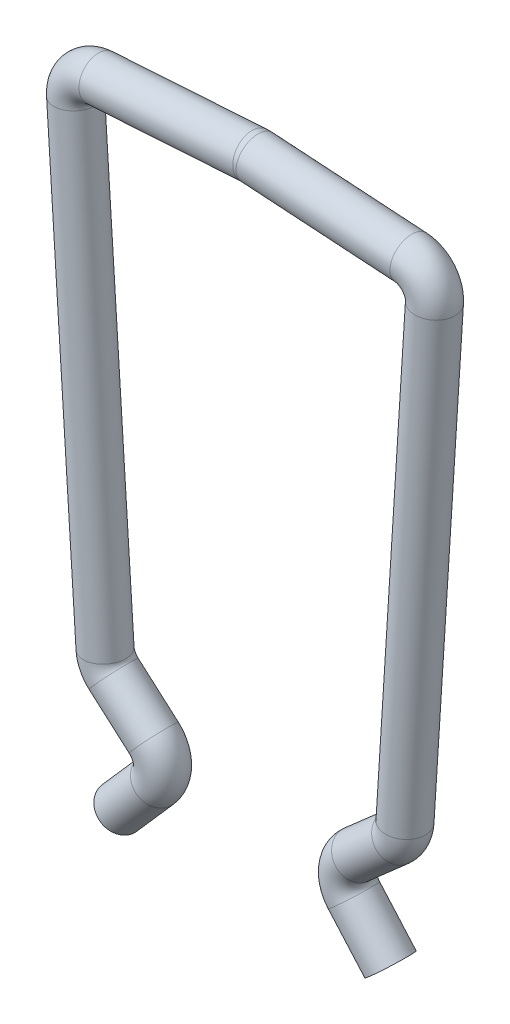
ISO-10303-21;
HEADER;
FILE_DESCRIPTION(('STEP AP214'),'2;1');
FILE_NAME('part.step','',(''),(''),'','','');
FILE_SCHEMA(('AUTOMOTIVE_DESIGN { 1 0 10303 214 1 1 1 1 }'));
ENDSEC;
DATA;
#1=APPLICATION_CONTEXT('core data for automotive mechanical design processes');
#2=APPLICATION_PROTOCOL_DEFINITION('international standard','automotive_design',2000,#1);
#3=PRODUCT_CONTEXT('',#1,'mechanical');
#4=PRODUCT('Part','Part','',(#3));
#5=PRODUCT_RELATED_PRODUCT_CATEGORY('part','',(#4));
#6=PRODUCT_DEFINITION_FORMATION('','',#4);
#7=PRODUCT_DEFINITION_CONTEXT('part definition',#1,'design');
#8=PRODUCT_DEFINITION('design','',#6,#7);
#9=PRODUCT_DEFINITION_SHAPE('','',#8);
#10=(LENGTH_UNIT() NAMED_UNIT(*) SI_UNIT(.MILLI.,.METRE.));
#11=(NAMED_UNIT(*) PLANE_ANGLE_UNIT() SI_UNIT($,.RADIAN.));
#12=(NAMED_UNIT(*) SI_UNIT($,.STERADIAN.) SOLID_ANGLE_UNIT());
#13=UNCERTAINTY_MEASURE_WITH_UNIT(LENGTH_MEASURE(1.E-05),#10,'distance_accuracy_value','');
#14=(GEOMETRIC_REPRESENTATION_CONTEXT(3) GLOBAL_UNCERTAINTY_ASSIGNED_CONTEXT((#13)) GLOBAL_UNIT_ASSIGNED_CONTEXT((#10,
#11,#12)) REPRESENTATION_CONTEXT('',''));
#15=CARTESIAN_POINT('',(0.,0.,0.));
#16=DIRECTION('',(0.,0.,1.));
#17=DIRECTION('',(1.,0.,0.));
#18=AXIS2_PLACEMENT_3D('',#15,#16,#17);
#19=CARTESIAN_POINT('',(1.92441755077506,-11.1004818464641,0.));
#20=DIRECTION('',(0.660114607728678,-0.751164898449876,0.));
#21=DIRECTION('',(0.751164898449877,0.660114607728678,0.));
#22=AXIS2_PLACEMENT_3D('',#19,#20,#21);
#23=CYLINDRICAL_SURFACE('',#22,0.4);
#24=CARTESIAN_POINT('',(1.92441755077506,-11.1004818464641,0.));
#25=DIRECTION('',(-0.660114607728679,0.751164898449876,0.));
#26=DIRECTION('',(-0.751164898449876,-0.660114607728679,0.));
#27=AXIS2_PLACEMENT_3D('',#24,#25,#26);
#28=CIRCLE('',#27,0.4);
#29=CARTESIAN_POINT('',(1.62395159139511,-11.3645276895556,0.));
#30=VERTEX_POINT('',#29);
#31=EDGE_CURVE('E49',#30,#30,#28,.T.);
#32=ORIENTED_EDGE('',*,*,#31,.F.);
#33=EDGE_LOOP('',(#32));
#34=FACE_BOUND('',#33,.T.);
#35=CARTESIAN_POINT('',(2.63727464717794,-11.9116640596122,0.));
#36=DIRECTION('',(-0.660114607728679,0.751164898449876,0.));
#37=DIRECTION('',(-0.751164898449876,-0.660114607728679,0.));
#38=AXIS2_PLACEMENT_3D('',#35,#36,#37);
#39=CIRCLE('',#38,0.4);
#40=CARTESIAN_POINT('',(2.33680868779799,-12.1757099027037,0.));
#41=VERTEX_POINT('',#40);
#42=EDGE_CURVE('E12',#41,#41,#39,.T.);
#43=ORIENTED_EDGE('',*,*,#42,.T.);
#44=EDGE_LOOP('',(#43));
#45=FACE_BOUND('',#44,.T.);
#46=ADVANCED_FACE('F43',(#34,#45),#23,.T.);
#47=CARTESIAN_POINT('',(2.3,-10.7704245425997,0.));
#48=DIRECTION('',(0.,0.,1.));
#49=DIRECTION('',(1.,0.,0.));
#50=AXIS2_PLACEMENT_3D('',#47,#48,#49);
#51=TOROIDAL_SURFACE('',#50,0.500000000000001,0.4);
#52=CARTESIAN_POINT('',(1.96994269613566,-10.3948420933748,0.));
#53=DIRECTION('',(0.751164898449883,0.660114607728672,0.));
#54=DIRECTION('',(-0.660114607728672,0.751164898449882,0.));
#55=AXIS2_PLACEMENT_3D('',#52,#53,#54);
#56=CIRCLE('',#55,0.4);
#57=CARTESIAN_POINT('',(1.70589685304419,-10.0943761339948,0.));
#58=VERTEX_POINT('',#57);
#59=EDGE_CURVE('E53',#58,#58,#56,.T.);
#60=CARTESIAN_POINT('',(2.3,-10.7704245425997,0.));
#61=DIRECTION('',(0.,0.,1.));
#62=DIRECTION('',(1.,0.,0.));
#63=AXIS2_PLACEMENT_3D('',#60,#61,#62);
#64=CIRCLE('',#63,0.900000000000001);
#65=EDGE_CURVE('',#58,#30,#64,.T.);
#66=ORIENTED_EDGE('',*,*,#59,.F.);
#67=ORIENTED_EDGE('',*,*,#31,.T.);
#68=ORIENTED_EDGE('',*,*,#65,.T.);
#69=ORIENTED_EDGE('',*,*,#65,.F.);
#70=EDGE_LOOP('',(#66,#68,#67,#69));
#71=FACE_BOUND('',#70,.T.);
#72=ADVANCED_FACE('F171',(#71),#51,.T.);
#73=CARTESIAN_POINT('',(2.74996559769337,-9.70936742230895,0.));
#74=DIRECTION('',(-0.751164898449882,-0.660114607728672,0.));
#75=DIRECTION('',(0.660114607728672,-0.751164898449882,0.));
#76=AXIS2_PLACEMENT_3D('',#73,#74,#75);
#77=CYLINDRICAL_SURFACE('',#76,0.4);
#78=CARTESIAN_POINT('',(2.74996559769337,-9.70936742230895,0.));
#79=DIRECTION('',(0.751164898449883,0.660114607728672,0.));
#80=DIRECTION('',(-0.660114607728672,0.751164898449882,0.));
#81=AXIS2_PLACEMENT_3D('',#78,#79,#80);
#82=CIRCLE('',#81,0.4);
#83=CARTESIAN_POINT('',(3.01401144078484,-10.0098333816889,0.));
#84=VERTEX_POINT('',#83);
#85=EDGE_CURVE('E57',#84,#84,#82,.T.);
#86=ORIENTED_EDGE('',*,*,#85,.F.);
#87=EDGE_LOOP('',(#86));
#88=FACE_BOUND('',#87,.T.);
#89=ORIENTED_EDGE('',*,*,#59,.T.);
#90=EDGE_LOOP('',(#89));
#91=FACE_BOUND('',#90,.T.);
#92=ADVANCED_FACE('F165',(#88,#91),#77,.T.);
#93=CARTESIAN_POINT('',(2.41990829382904,-9.33378497308401,0.));
#94=DIRECTION('',(0.,0.,-1.));
#95=DIRECTION('',(-1.,0.,0.));
#96=AXIS2_PLACEMENT_3D('',#93,#94,#95);
#97=TOROIDAL_SURFACE('',#96,0.499999999999998,0.4);
#98=CARTESIAN_POINT('',(2.91890363237202,-9.36546544202583,0.));
#99=DIRECTION('',(0.0633609378836384,0.997990677085967,0.));
#100=DIRECTION('',(-0.997990677085966,0.0633609378836384,0.));
#101=AXIS2_PLACEMENT_3D('',#98,#99,#100);
#102=CIRCLE('',#101,0.4);
#103=CARTESIAN_POINT('',(3.31809990320641,-9.39080981717928,0.));
#104=VERTEX_POINT('',#103);
#105=EDGE_CURVE('E62',#104,#104,#102,.T.);
#106=CARTESIAN_POINT('',(2.41990829382904,-9.33378497308401,0.));
#107=DIRECTION('',(0.,0.,-1.));
#108=DIRECTION('',(-1.,0.,0.));
#109=AXIS2_PLACEMENT_3D('',#106,#107,#108);
#110=CIRCLE('',#109,0.899999999999998);
#111=EDGE_CURVE('',#104,#84,#110,.T.);
#112=ORIENTED_EDGE('',*,*,#105,.F.);
#113=ORIENTED_EDGE('',*,*,#85,.T.);
#114=ORIENTED_EDGE('',*,*,#111,.T.);
#115=ORIENTED_EDGE('',*,*,#111,.F.);
#116=EDGE_LOOP('',(#112,#114,#113,#115));
#117=FACE_BOUND('',#116,.T.);
#118=ADVANCED_FACE('F159',(#117),#97,.T.);
#119=CARTESIAN_POINT('',(3.49286665827772,-0.325041357744119,0.));
#120=DIRECTION('',(-0.0633609378836405,-0.997990677085966,0.));
#121=DIRECTION('',(0.997990677085966,-0.0633609378836405,0.));
#122=AXIS2_PLACEMENT_3D('',#119,#120,#121);
#123=CYLINDRICAL_SURFACE('',#122,0.4);
#124=CARTESIAN_POINT('',(3.49286665827772,-0.325041357744119,0.));
#125=DIRECTION('',(0.0633609378836384,0.997990677085967,0.));
#126=DIRECTION('',(-0.997990677085966,0.0633609378836384,0.));
#127=AXIS2_PLACEMENT_3D('',#124,#125,#126);
#128=CIRCLE('',#127,0.4);
#129=CARTESIAN_POINT('',(3.89206292911211,-0.350385732897575,0.));
#130=VERTEX_POINT('',#129);
#131=EDGE_CURVE('E65',#130,#130,#128,.T.);
#132=ORIENTED_EDGE('',*,*,#131,.F.);
#133=EDGE_LOOP('',(#132));
#134=FACE_BOUND('',#133,.T.);
#135=ORIENTED_EDGE('',*,*,#105,.T.);
#136=EDGE_LOOP('',(#135));
#137=FACE_BOUND('',#136,.T.);
#138=ADVANCED_FACE('F153',(#134,#137),#123,.T.);
#139=CARTESIAN_POINT('',(2.99387131973474,-0.293360888802299,0.));
#140=DIRECTION('',(0.,0.,-1.));
#141=DIRECTION('',(-1.,0.,0.));
#142=AXIS2_PLACEMENT_3D('',#139,#140,#141);
#143=TOROIDAL_SURFACE('',#142,0.499999999999997,0.4);
#144=CARTESIAN_POINT('',(3.02606245873372,0.205601765681927,0.));
#145=DIRECTION('',(-0.997925308968459,0.0643822779979624,0.));
#146=DIRECTION('',(-0.0643822779979624,-0.997925308968458,0.));
#147=AXIS2_PLACEMENT_3D('',#144,#145,#146);
#148=CIRCLE('',#147,0.4);
#149=CARTESIAN_POINT('',(3.05181536993291,0.60477188926931,0.));
#150=VERTEX_POINT('',#149);
#151=EDGE_CURVE('E68',#150,#150,#148,.T.);
#152=CARTESIAN_POINT('',(2.99387131973474,-0.293360888802299,0.));
#153=DIRECTION('',(0.,0.,-1.));
#154=DIRECTION('',(-1.,0.,0.));
#155=AXIS2_PLACEMENT_3D('',#152,#153,#154);
#156=CIRCLE('',#155,0.899999999999997);
#157=EDGE_CURVE('',#150,#130,#156,.T.);
#158=ORIENTED_EDGE('',*,*,#151,.F.);
#159=ORIENTED_EDGE('',*,*,#131,.T.);
#160=ORIENTED_EDGE('',*,*,#157,.T.);
#161=ORIENTED_EDGE('',*,*,#157,.F.);
#162=EDGE_LOOP('',(#158,#160,#159,#161));
#163=FACE_BOUND('',#162,.T.);
#164=ADVANCED_FACE('F147',(#163),#143,.T.);
#165=CARTESIAN_POINT('',(0.0321911389989816,0.39875475405191,0.));
#166=DIRECTION('',(0.997925308968458,-0.0643822779979648,0.));
#167=DIRECTION('',(0.0643822779979648,0.997925308968458,0.));
#168=AXIS2_PLACEMENT_3D('',#165,#166,#167);
#169=CYLINDRICAL_SURFACE('',#168,0.4);
#170=CARTESIAN_POINT('',(0.0321911389989816,0.39875475405191,0.));
#171=DIRECTION('',(-0.997925308968459,0.0643822779979624,0.));
#172=DIRECTION('',(-0.0643822779979624,-0.997925308968458,0.));
#173=AXIS2_PLACEMENT_3D('',#170,#171,#172);
#174=CIRCLE('',#173,0.4);
#175=CARTESIAN_POINT('',(0.057944050198167,0.797924877639293,0.));
#176=VERTEX_POINT('',#175);
#177=EDGE_CURVE('E71',#176,#176,#174,.T.);
#178=ORIENTED_EDGE('',*,*,#177,.F.);
#179=EDGE_LOOP('',(#178));
#180=FACE_BOUND('',#179,.T.);
#181=ORIENTED_EDGE('',*,*,#151,.T.);
#182=EDGE_LOOP('',(#181));
#183=FACE_BOUND('',#182,.T.);
#184=ADVANCED_FACE('F141',(#180,#183),#169,.T.);
#185=CARTESIAN_POINT('',(0.,-0.100207900432317,0.));
#186=DIRECTION('',(0.,0.,-1.));
#187=DIRECTION('',(-1.,0.,0.));
#188=AXIS2_PLACEMENT_3D('',#185,#186,#187);
#189=TOROIDAL_SURFACE('',#188,0.499999999999997,0.4);
#190=CARTESIAN_POINT('',(-0.0321911389989829,0.39875475405191,0.));
#191=DIRECTION('',(-0.997925308968458,-0.0643822779979673,0.));
#192=DIRECTION('',(0.0643822779979673,-0.997925308968458,0.));
#193=AXIS2_PLACEMENT_3D('',#190,#191,#192);
#194=CIRCLE('',#193,0.4);
#195=CARTESIAN_POINT('',(-0.0579440501981694,0.797924877639293,0.));
#196=VERTEX_POINT('',#195);
#197=EDGE_CURVE('E74',#196,#196,#194,.T.);
#198=CARTESIAN_POINT('',(0.,-0.100207900432317,0.));
#199=DIRECTION('',(0.,0.,-1.));
#200=DIRECTION('',(-1.,0.,0.));
#201=AXIS2_PLACEMENT_3D('',#198,#199,#200);
#202=CIRCLE('',#201,0.899999999999997);
#203=EDGE_CURVE('',#196,#176,#202,.T.);
#204=ORIENTED_EDGE('',*,*,#197,.F.);
#205=ORIENTED_EDGE('',*,*,#177,.T.);
#206=ORIENTED_EDGE('',*,*,#203,.T.);
#207=ORIENTED_EDGE('',*,*,#203,.F.);
#208=EDGE_LOOP('',(#204,#206,#205,#207));
#209=FACE_BOUND('',#208,.T.);
#210=ADVANCED_FACE('F135',(#209),#189,.T.);
#211=CARTESIAN_POINT('',(-3.02606245873372,0.205601765681926,0.));
#212=DIRECTION('',(0.997925308968458,0.0643822779979651,0.));
#213=DIRECTION('',(-0.0643822779979651,0.997925308968458,0.));
#214=AXIS2_PLACEMENT_3D('',#211,#212,#213);
#215=CYLINDRICAL_SURFACE('',#214,0.4);
#216=CARTESIAN_POINT('',(-3.02606245873372,0.205601765681926,0.));
#217=DIRECTION('',(-0.997925308968458,-0.0643822779979673,0.));
#218=DIRECTION('',(0.0643822779979673,-0.997925308968458,0.));
#219=AXIS2_PLACEMENT_3D('',#216,#217,#218);
#220=CIRCLE('',#219,0.4);
#221=CARTESIAN_POINT('',(-3.05181536993291,0.604771889269309,0.));
#222=VERTEX_POINT('',#221);
#223=EDGE_CURVE('E77',#222,#222,#220,.T.);
#224=ORIENTED_EDGE('',*,*,#223,.F.);
#225=EDGE_LOOP('',(#224));
#226=FACE_BOUND('',#225,.T.);
#227=ORIENTED_EDGE('',*,*,#197,.T.);
#228=EDGE_LOOP('',(#227));
#229=FACE_BOUND('',#228,.T.);
#230=ADVANCED_FACE('F129',(#226,#229),#215,.T.);
#231=CARTESIAN_POINT('',(-2.99387131973474,-0.2933608888023,0.));
#232=DIRECTION('',(0.,0.,-1.));
#233=DIRECTION('',(-1.,0.,0.));
#234=AXIS2_PLACEMENT_3D('',#231,#232,#233);
#235=TOROIDAL_SURFACE('',#234,0.499999999999997,0.4);
#236=CARTESIAN_POINT('',(-3.49286665827772,-0.325041357744121,0.));
#237=DIRECTION('',(0.0633609378836433,-0.997990677085966,0.));
#238=DIRECTION('',(0.997990677085966,0.0633609378836433,0.));
#239=AXIS2_PLACEMENT_3D('',#236,#237,#238);
#240=CIRCLE('',#239,0.4);
#241=CARTESIAN_POINT('',(-3.89206292911211,-0.350385732897577,0.));
#242=VERTEX_POINT('',#241);
#243=EDGE_CURVE('E80',#242,#242,#240,.T.);
#244=CARTESIAN_POINT('',(-2.99387131973474,-0.2933608888023,0.));
#245=DIRECTION('',(0.,0.,-1.));
#246=DIRECTION('',(-1.,0.,0.));
#247=AXIS2_PLACEMENT_3D('',#244,#245,#246);
#248=CIRCLE('',#247,0.899999999999996);
#249=EDGE_CURVE('',#242,#222,#248,.T.);
#250=ORIENTED_EDGE('',*,*,#243,.F.);
#251=ORIENTED_EDGE('',*,*,#223,.T.);
#252=ORIENTED_EDGE('',*,*,#249,.T.);
#253=ORIENTED_EDGE('',*,*,#249,.F.);
#254=EDGE_LOOP('',(#250,#252,#251,#253));
#255=FACE_BOUND('',#254,.T.);
#256=ADVANCED_FACE('F123',(#255),#235,.T.);
#257=CARTESIAN_POINT('',(-2.91890363237202,-9.36546544202583,0.));
#258=DIRECTION('',(-0.0633609378836409,0.997990677085966,0.));
#259=DIRECTION('',(-0.997990677085966,-0.0633609378836409,0.));
#260=AXIS2_PLACEMENT_3D('',#257,#258,#259);
#261=CYLINDRICAL_SURFACE('',#260,0.4);
#262=CARTESIAN_POINT('',(-2.91890363237202,-9.36546544202583,0.));
#263=DIRECTION('',(0.0633609378836433,-0.997990677085966,0.));
#264=DIRECTION('',(0.997990677085966,0.0633609378836433,0.));
#265=AXIS2_PLACEMENT_3D('',#262,#263,#264);
#266=CIRCLE('',#265,0.4);
#267=CARTESIAN_POINT('',(-3.3180999032064,-9.39080981717929,0.));
#268=VERTEX_POINT('',#267);
#269=EDGE_CURVE('E83',#268,#268,#266,.T.);
#270=ORIENTED_EDGE('',*,*,#269,.F.);
#271=EDGE_LOOP('',(#270));
#272=FACE_BOUND('',#271,.T.);
#273=ORIENTED_EDGE('',*,*,#243,.T.);
#274=EDGE_LOOP('',(#273));
#275=FACE_BOUND('',#274,.T.);
#276=ADVANCED_FACE('F117',(#272,#275),#261,.T.);
#277=CARTESIAN_POINT('',(-2.41990829382904,-9.33378497308401,0.));
#278=DIRECTION('',(0.,0.,-1.));
#279=DIRECTION('',(-1.,0.,0.));
#280=AXIS2_PLACEMENT_3D('',#277,#278,#279);
#281=TOROIDAL_SURFACE('',#280,0.499999999999996,0.4);
#282=CARTESIAN_POINT('',(-2.74996559769337,-9.70936742230895,0.));
#283=DIRECTION('',(0.75116489844988,-0.660114607728675,0.));
#284=DIRECTION('',(0.660114607728675,0.75116489844988,0.));
#285=AXIS2_PLACEMENT_3D('',#282,#283,#284);
#286=CIRCLE('',#285,0.4);
#287=CARTESIAN_POINT('',(-3.01401144078484,-10.0098333816889,0.));
#288=VERTEX_POINT('',#287);
#289=EDGE_CURVE('E86',#288,#288,#286,.T.);
#290=CARTESIAN_POINT('',(-2.41990829382904,-9.33378497308401,0.));
#291=DIRECTION('',(0.,0.,-1.));
#292=DIRECTION('',(-1.,0.,0.));
#293=AXIS2_PLACEMENT_3D('',#290,#291,#292);
#294=CIRCLE('',#293,0.899999999999996);
#295=EDGE_CURVE('',#288,#268,#294,.T.);
#296=ORIENTED_EDGE('',*,*,#289,.F.);
#297=ORIENTED_EDGE('',*,*,#269,.T.);
#298=ORIENTED_EDGE('',*,*,#295,.T.);
#299=ORIENTED_EDGE('',*,*,#295,.F.);
#300=EDGE_LOOP('',(#296,#298,#297,#299));
#301=FACE_BOUND('',#300,.T.);
#302=ADVANCED_FACE('F111',(#301),#281,.T.);
#303=CARTESIAN_POINT('',(-1.96994269613566,-10.3948420933748,0.));
#304=DIRECTION('',(-0.75116489844988,0.660114607728674,0.));
#305=DIRECTION('',(-0.660114607728674,-0.751164898449881,0.));
#306=AXIS2_PLACEMENT_3D('',#303,#304,#305);
#307=CYLINDRICAL_SURFACE('',#306,0.4);
#308=CARTESIAN_POINT('',(-1.96994269613566,-10.3948420933748,0.));
#309=DIRECTION('',(0.75116489844988,-0.660114607728675,0.));
#310=DIRECTION('',(0.660114607728675,0.75116489844988,0.));
#311=AXIS2_PLACEMENT_3D('',#308,#309,#310);
#312=CIRCLE('',#311,0.4);
#313=CARTESIAN_POINT('',(-1.70589685304419,-10.0943761339948,0.));
#314=VERTEX_POINT('',#313);
#315=EDGE_CURVE('E89',#314,#314,#312,.T.);
#316=ORIENTED_EDGE('',*,*,#315,.F.);
#317=EDGE_LOOP('',(#316));
#318=FACE_BOUND('',#317,.T.);
#319=ORIENTED_EDGE('',*,*,#289,.T.);
#320=EDGE_LOOP('',(#319));
#321=FACE_BOUND('',#320,.T.);
#322=ADVANCED_FACE('F105',(#318,#321),#307,.T.);
#323=CARTESIAN_POINT('',(-2.3,-10.7704245425997,0.));
#324=DIRECTION('',(0.,0.,1.));
#325=DIRECTION('',(1.,0.,0.));
#326=AXIS2_PLACEMENT_3D('',#323,#324,#325);
#327=TOROIDAL_SURFACE('',#326,0.500000000000003,0.4);
#328=CARTESIAN_POINT('',(-1.92441755077506,-11.1004818464641,0.));
#329=DIRECTION('',(-0.660114607728677,-0.751164898449878,0.));
#330=DIRECTION('',(0.751164898449878,-0.660114607728677,0.));
#331=AXIS2_PLACEMENT_3D('',#328,#329,#330);
#332=CIRCLE('',#331,0.4);
#333=CARTESIAN_POINT('',(-1.62395159139511,-11.3645276895556,0.));
#334=VERTEX_POINT('',#333);
#335=EDGE_CURVE('E92',#334,#334,#332,.T.);
#336=CARTESIAN_POINT('',(-2.3,-10.7704245425997,0.));
#337=DIRECTION('',(0.,0.,1.));
#338=DIRECTION('',(1.,0.,0.));
#339=AXIS2_PLACEMENT_3D('',#336,#337,#338);
#340=CIRCLE('',#339,0.900000000000003);
#341=EDGE_CURVE('',#334,#314,#340,.T.);
#342=ORIENTED_EDGE('',*,*,#335,.F.);
#343=ORIENTED_EDGE('',*,*,#315,.T.);
#344=ORIENTED_EDGE('',*,*,#341,.T.);
#345=ORIENTED_EDGE('',*,*,#341,.F.);
#346=EDGE_LOOP('',(#342,#344,#343,#345));
#347=FACE_BOUND('',#346,.T.);
#348=ADVANCED_FACE('F102',(#347),#327,.T.);
#349=CARTESIAN_POINT('',(-1.92441755077506,-11.1004818464641,0.));
#350=DIRECTION('',(-0.660114607728677,-0.751164898449878,0.));
#351=DIRECTION('',(0.751164898449878,-0.660114607728677,0.));
#352=AXIS2_PLACEMENT_3D('',#349,#350,#351);
#353=CYLINDRICAL_SURFACE('',#352,0.4);
#354=ORIENTED_EDGE('',*,*,#335,.T.);
#355=EDGE_LOOP('',(#354));
#356=FACE_BOUND('',#355,.T.);
#357=CARTESIAN_POINT('',(-2.63727464717794,-11.9116640596122,0.));
#358=DIRECTION('',(-0.660114607728677,-0.751164898449878,0.));
#359=DIRECTION('',(0.751164898449878,-0.660114607728677,0.));
#360=AXIS2_PLACEMENT_3D('',#357,#358,#359);
#361=CIRCLE('',#360,0.4);
#362=CARTESIAN_POINT('',(-2.33680868779799,-12.1757099027037,0.));
#363=VERTEX_POINT('',#362);
#364=EDGE_CURVE('E93',#363,#363,#361,.T.);
#365=ORIENTED_EDGE('',*,*,#364,.F.);
#366=EDGE_LOOP('',(#365));
#367=FACE_BOUND('',#366,.T.);
#368=ADVANCED_FACE('F99',(#356,#367),#353,.T.);
#369=CARTESIAN_POINT('',(2.63727464717794,-11.9116640596122,0.));
#370=DIRECTION('',(-0.660114607728679,0.751164898449876,0.));
#371=DIRECTION('',(-0.751164898449876,-0.660114607728679,0.));
#372=AXIS2_PLACEMENT_3D('',#369,#370,#371);
#373=PLANE('',#372);
#374=ORIENTED_EDGE('',*,*,#42,.F.);
#375=EDGE_LOOP('',(#374));
#376=FACE_BOUND('',#375,.T.);
#377=ADVANCED_FACE('F183',(#376),#373,.F.);
#378=CARTESIAN_POINT('',(-2.63727464717794,-11.9116640596122,0.));
#379=DIRECTION('',(-0.660114607728677,-0.751164898449878,0.));
#380=DIRECTION('',(0.751164898449878,-0.660114607728677,0.));
#381=AXIS2_PLACEMENT_3D('',#378,#379,#380);
#382=PLANE('',#381);
#383=ORIENTED_EDGE('',*,*,#364,.T.);
#384=EDGE_LOOP('',(#383));
#385=FACE_BOUND('',#384,.T.);
#386=ADVANCED_FACE('F184',(#385),#382,.T.);
#387=CLOSED_SHELL('',(#46,#72,#92,#118,#138,#164,#184,#210,#230,#256,#276,#302,#322,#348,#368,
#377,#386));
#388=MANIFOLD_SOLID_BREP('B2',#387);
#389=ADVANCED_BREP_SHAPE_REPRESENTATION('',(#18,#388),#14);
#390=SHAPE_DEFINITION_REPRESENTATION(#9,#389);
ENDSEC;
END-ISO-10303-21;
